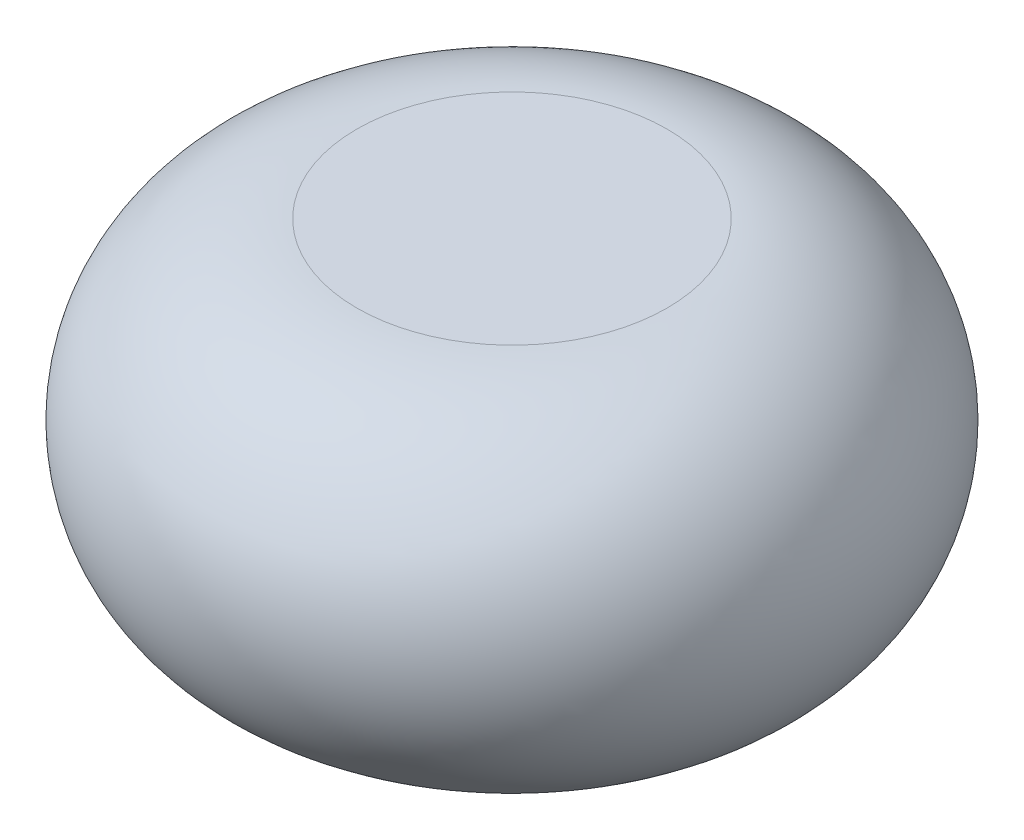
ISO-10303-21;
HEADER;
FILE_DESCRIPTION(('STEP AP214'),'2;1');
FILE_NAME('part.step','',(''),(''),'','','');
FILE_SCHEMA(('AUTOMOTIVE_DESIGN { 1 0 10303 214 1 1 1 1 }'));
ENDSEC;
DATA;
#1=APPLICATION_CONTEXT('core data for automotive mechanical design processes');
#2=APPLICATION_PROTOCOL_DEFINITION('international standard','automotive_design',2000,#1);
#3=PRODUCT_CONTEXT('',#1,'mechanical');
#4=PRODUCT('Part','Part','',(#3));
#5=PRODUCT_RELATED_PRODUCT_CATEGORY('part','',(#4));
#6=PRODUCT_DEFINITION_FORMATION('','',#4);
#7=PRODUCT_DEFINITION_CONTEXT('part definition',#1,'design');
#8=PRODUCT_DEFINITION('design','',#6,#7);
#9=PRODUCT_DEFINITION_SHAPE('','',#8);
#10=(LENGTH_UNIT() NAMED_UNIT(*) SI_UNIT(.MILLI.,.METRE.));
#11=(NAMED_UNIT(*) PLANE_ANGLE_UNIT() SI_UNIT($,.RADIAN.));
#12=(NAMED_UNIT(*) SI_UNIT($,.STERADIAN.) SOLID_ANGLE_UNIT());
#13=UNCERTAINTY_MEASURE_WITH_UNIT(LENGTH_MEASURE(1.E-05),#10,'distance_accuracy_value','');
#14=(GEOMETRIC_REPRESENTATION_CONTEXT(3) GLOBAL_UNCERTAINTY_ASSIGNED_CONTEXT((#13)) GLOBAL_UNIT_ASSIGNED_CONTEXT((#10,
#11,#12)) REPRESENTATION_CONTEXT('',''));
#15=CARTESIAN_POINT('',(0.,0.,0.));
#16=DIRECTION('',(0.,0.,1.));
#17=DIRECTION('',(1.,0.,0.));
#18=AXIS2_PLACEMENT_3D('',#15,#16,#17);
#19=CARTESIAN_POINT('',(0.,62.5,0.));
#20=DIRECTION('',(0.,1.,0.));
#21=DIRECTION('',(0.,0.,1.));
#22=AXIS2_PLACEMENT_3D('',#19,#20,#21);
#23=DEGENERATE_TOROIDAL_SURFACE('',#22,500.000000000001,562.5,.T.);
#24=CARTESIAN_POINT('',(0.,625.,0.));
#25=DIRECTION('',(0.,1.,0.));
#26=DIRECTION('',(0.,0.,1.));
#27=AXIS2_PLACEMENT_3D('',#24,#25,#26);
#28=CIRCLE('',#27,500.000000000001);
#29=CARTESIAN_POINT('',(0.,625.,500.000000000001));
#30=VERTEX_POINT('',#29);
#31=EDGE_CURVE('E10',#30,#30,#28,.T.);
#32=ORIENTED_EDGE('',*,*,#31,.F.);
#33=EDGE_LOOP('',(#32));
#34=FACE_BOUND('',#33,.T.);
#35=CARTESIAN_POINT('',(0.,-500.,0.));
#36=DIRECTION('',(0.,1.,0.));
#37=DIRECTION('',(0.,0.,1.));
#38=AXIS2_PLACEMENT_3D('',#35,#36,#37);
#39=CIRCLE('',#38,500.000000000001);
#40=CARTESIAN_POINT('',(0.,-500.,500.000000000001));
#41=VERTEX_POINT('',#40);
#42=EDGE_CURVE('E42',#41,#41,#39,.T.);
#43=ORIENTED_EDGE('',*,*,#42,.T.);
#44=EDGE_LOOP('',(#43));
#45=FACE_BOUND('',#44,.T.);
#46=ADVANCED_FACE('F36',(#34,#45),#23,.T.);
#47=CARTESIAN_POINT('',(6.50825729785752E-13,625.,0.));
#48=DIRECTION('',(0.,-1.,0.));
#49=DIRECTION('',(0.,0.,-1.));
#50=AXIS2_PLACEMENT_3D('',#47,#48,#49);
#51=PLANE('',#50);
#52=ORIENTED_EDGE('',*,*,#31,.T.);
#53=EDGE_LOOP('',(#52));
#54=FACE_BOUND('',#53,.T.);
#55=ADVANCED_FACE('F51',(#54),#51,.F.);
#56=CARTESIAN_POINT('',(6.66133814775094E-13,-500.,0.));
#57=DIRECTION('',(0.,1.,0.));
#58=DIRECTION('',(0.,0.,1.));
#59=AXIS2_PLACEMENT_3D('',#56,#57,#58);
#60=PLANE('',#59);
#61=ORIENTED_EDGE('',*,*,#42,.F.);
#62=EDGE_LOOP('',(#61));
#63=FACE_BOUND('',#62,.T.);
#64=ADVANCED_FACE('F49',(#63),#60,.F.);
#65=CLOSED_SHELL('',(#46,#55,#64));
#66=MANIFOLD_SOLID_BREP('B2',#65);
#67=ADVANCED_BREP_SHAPE_REPRESENTATION('',(#18,#66),#14);
#68=SHAPE_DEFINITION_REPRESENTATION(#9,#67);
ENDSEC;
END-ISO-10303-21;
